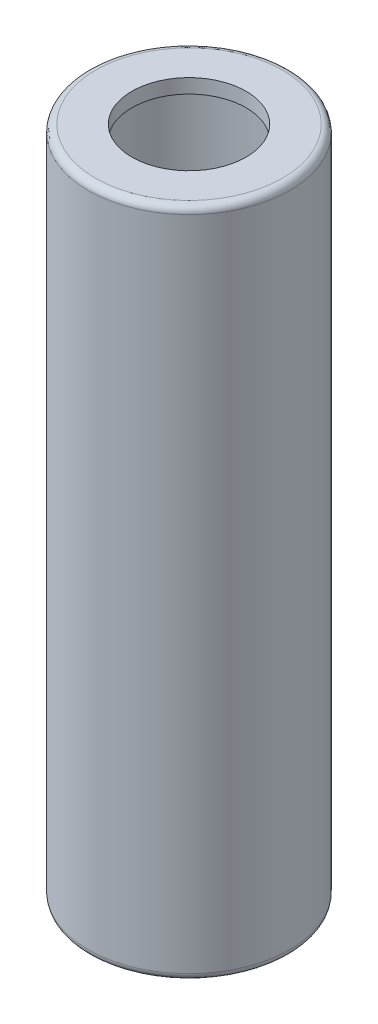
ISO-10303-21;
HEADER;
FILE_DESCRIPTION(('STEP AP214'),'2;1');
FILE_NAME('part.step','',(''),(''),'','','');
FILE_SCHEMA(('AUTOMOTIVE_DESIGN { 1 0 10303 214 1 1 1 1 }'));
ENDSEC;
DATA;
#1=APPLICATION_CONTEXT('core data for automotive mechanical design processes');
#2=APPLICATION_PROTOCOL_DEFINITION('international standard','automotive_design',2000,#1);
#3=PRODUCT_CONTEXT('',#1,'mechanical');
#4=PRODUCT('Part','Part','',(#3));
#5=PRODUCT_RELATED_PRODUCT_CATEGORY('part','',(#4));
#6=PRODUCT_DEFINITION_FORMATION('','',#4);
#7=PRODUCT_DEFINITION_CONTEXT('part definition',#1,'design');
#8=PRODUCT_DEFINITION('design','',#6,#7);
#9=PRODUCT_DEFINITION_SHAPE('','',#8);
#10=(LENGTH_UNIT() NAMED_UNIT(*) SI_UNIT(.MILLI.,.METRE.));
#11=(NAMED_UNIT(*) PLANE_ANGLE_UNIT() SI_UNIT($,.RADIAN.));
#12=(NAMED_UNIT(*) SI_UNIT($,.STERADIAN.) SOLID_ANGLE_UNIT());
#13=UNCERTAINTY_MEASURE_WITH_UNIT(LENGTH_MEASURE(1.E-05),#10,'distance_accuracy_value','');
#14=(GEOMETRIC_REPRESENTATION_CONTEXT(3) GLOBAL_UNCERTAINTY_ASSIGNED_CONTEXT((#13)) GLOBAL_UNIT_ASSIGNED_CONTEXT((#10,
#11,#12)) REPRESENTATION_CONTEXT('',''));
#15=CARTESIAN_POINT('',(0.,0.,0.));
#16=DIRECTION('',(0.,0.,1.));
#17=DIRECTION('',(1.,0.,0.));
#18=AXIS2_PLACEMENT_3D('',#15,#16,#17);
#19=CARTESIAN_POINT('',(0.,94.,0.));
#20=DIRECTION('',(0.,-1.,0.));
#21=DIRECTION('',(0.,0.,-1.));
#22=AXIS2_PLACEMENT_3D('',#19,#20,#21);
#23=CYLINDRICAL_SURFACE('',#22,14.1);
#24=CARTESIAN_POINT('',(0.,93.,0.));
#25=DIRECTION('',(0.,1.,0.));
#26=DIRECTION('',(0.,0.,1.));
#27=AXIS2_PLACEMENT_3D('',#24,#25,#26);
#28=CIRCLE('',#27,14.1);
#29=CARTESIAN_POINT('',(0.,93.,14.1));
#30=VERTEX_POINT('',#29);
#31=EDGE_CURVE('E10',#30,#30,#28,.F.);
#32=ORIENTED_EDGE('',*,*,#31,.T.);
#33=EDGE_LOOP('',(#32));
#34=FACE_BOUND('',#33,.T.);
#35=CARTESIAN_POINT('',(0.,0.916515138991172,0.));
#36=DIRECTION('',(0.,-1.,0.));
#37=DIRECTION('',(0.,0.,-1.));
#38=AXIS2_PLACEMENT_3D('',#35,#36,#37);
#39=CIRCLE('',#38,14.1);
#40=CARTESIAN_POINT('',(0.,0.916515138991172,-14.1));
#41=VERTEX_POINT('',#40);
#42=EDGE_CURVE('E50',#41,#41,#39,.F.);
#43=ORIENTED_EDGE('',*,*,#42,.T.);
#44=EDGE_LOOP('',(#43));
#45=FACE_BOUND('',#44,.T.);
#46=ADVANCED_FACE('F37',(#34,#45),#23,.T.);
#47=CARTESIAN_POINT('',(0.,94.,0.));
#48=DIRECTION('',(0.,1.,0.));
#49=DIRECTION('',(0.,0.,1.));
#50=AXIS2_PLACEMENT_3D('',#47,#48,#49);
#51=PLANE('',#50);
#52=CARTESIAN_POINT('',(0.,94.,0.));
#53=DIRECTION('',(0.,1.,0.));
#54=DIRECTION('',(0.,0.,1.));
#55=AXIS2_PLACEMENT_3D('',#52,#53,#54);
#56=CIRCLE('',#55,8.);
#57=CARTESIAN_POINT('',(0.,94.,8.));
#58=VERTEX_POINT('',#57);
#59=EDGE_CURVE('E70',#58,#58,#56,.T.);
#60=ORIENTED_EDGE('',*,*,#59,.F.);
#61=EDGE_LOOP('',(#60));
#62=FACE_BOUND('',#61,.T.);
#63=CARTESIAN_POINT('',(0.,94.,0.));
#64=DIRECTION('',(0.,1.,0.));
#65=DIRECTION('',(0.,0.,1.));
#66=AXIS2_PLACEMENT_3D('',#63,#64,#65);
#67=CIRCLE('',#66,13.1);
#68=CARTESIAN_POINT('',(0.,94.,13.1));
#69=VERTEX_POINT('',#68);
#70=EDGE_CURVE('E45',#69,#69,#67,.T.);
#71=ORIENTED_EDGE('',*,*,#70,.T.);
#72=EDGE_LOOP('',(#71));
#73=FACE_BOUND('',#72,.T.);
#74=ADVANCED_FACE('F87',(#62,#73),#51,.T.);
#75=CARTESIAN_POINT('',(0.,92.,0.));
#76=DIRECTION('',(0.,-1.,0.));
#77=DIRECTION('',(0.,0.,-1.));
#78=AXIS2_PLACEMENT_3D('',#75,#76,#77);
#79=CYLINDRICAL_SURFACE('',#78,12.5);
#80=CARTESIAN_POINT('',(0.,1.,0.));
#81=DIRECTION('',(0.,1.,0.));
#82=DIRECTION('',(0.,0.,1.));
#83=AXIS2_PLACEMENT_3D('',#80,#81,#82);
#84=CIRCLE('',#83,12.5);
#85=CARTESIAN_POINT('',(0.,1.,12.5));
#86=VERTEX_POINT('',#85);
#87=EDGE_CURVE('E61',#86,#86,#84,.F.);
#88=ORIENTED_EDGE('',*,*,#87,.T.);
#89=EDGE_LOOP('',(#88));
#90=FACE_BOUND('',#89,.T.);
#91=CARTESIAN_POINT('',(0.,92.,0.));
#92=DIRECTION('',(0.,-1.,0.));
#93=DIRECTION('',(0.,0.,-1.));
#94=AXIS2_PLACEMENT_3D('',#91,#92,#93);
#95=CIRCLE('',#94,12.5);
#96=CARTESIAN_POINT('',(0.,92.,-12.5));
#97=VERTEX_POINT('',#96);
#98=EDGE_CURVE('E65',#97,#97,#95,.T.);
#99=ORIENTED_EDGE('',*,*,#98,.F.);
#100=EDGE_LOOP('',(#99));
#101=FACE_BOUND('',#100,.T.);
#102=ADVANCED_FACE('F89',(#90,#101),#79,.F.);
#103=CARTESIAN_POINT('',(0.,92.,0.));
#104=DIRECTION('',(0.,-1.,0.));
#105=DIRECTION('',(0.,0.,-1.));
#106=AXIS2_PLACEMENT_3D('',#103,#104,#105);
#107=PLANE('',#106);
#108=CARTESIAN_POINT('',(0.,92.,0.));
#109=DIRECTION('',(0.,1.,0.));
#110=DIRECTION('',(0.,0.,1.));
#111=AXIS2_PLACEMENT_3D('',#108,#109,#110);
#112=CIRCLE('',#111,8.);
#113=CARTESIAN_POINT('',(0.,92.,8.));
#114=VERTEX_POINT('',#113);
#115=EDGE_CURVE('E69',#114,#114,#112,.T.);
#116=ORIENTED_EDGE('',*,*,#115,.T.);
#117=EDGE_LOOP('',(#116));
#118=FACE_BOUND('',#117,.T.);
#119=ORIENTED_EDGE('',*,*,#98,.T.);
#120=EDGE_LOOP('',(#119));
#121=FACE_BOUND('',#120,.T.);
#122=ADVANCED_FACE('F78',(#118,#121),#107,.T.);
#123=CARTESIAN_POINT('',(0.,1.,0.));
#124=DIRECTION('',(0.,1.,0.));
#125=DIRECTION('',(0.,0.,1.));
#126=AXIS2_PLACEMENT_3D('',#123,#124,#125);
#127=TOROIDAL_SURFACE('',#126,13.5,1.);
#128=CARTESIAN_POINT('',(0.,0.,0.));
#129=DIRECTION('',(0.,1.,0.));
#130=DIRECTION('',(0.,0.,1.));
#131=AXIS2_PLACEMENT_3D('',#128,#129,#130);
#132=CIRCLE('',#131,13.5);
#133=CARTESIAN_POINT('',(0.,0.,13.5));
#134=VERTEX_POINT('',#133);
#135=EDGE_CURVE('E55',#134,#134,#132,.T.);
#136=ORIENTED_EDGE('',*,*,#135,.F.);
#137=EDGE_LOOP('',(#136));
#138=FACE_BOUND('',#137,.T.);
#139=ORIENTED_EDGE('',*,*,#87,.F.);
#140=EDGE_LOOP('',(#139));
#141=FACE_BOUND('',#140,.T.);
#142=ADVANCED_FACE('F100',(#138,#141),#127,.T.);
#143=CARTESIAN_POINT('',(0.,0.916515138991168,0.));
#144=DIRECTION('',(0.,-1.,0.));
#145=DIRECTION('',(0.,0.,-1.));
#146=AXIS2_PLACEMENT_3D('',#143,#144,#145);
#147=TOROIDAL_SURFACE('',#146,13.1,1.);
#148=ORIENTED_EDGE('',*,*,#135,.T.);
#149=EDGE_LOOP('',(#148));
#150=FACE_BOUND('',#149,.T.);
#151=ORIENTED_EDGE('',*,*,#42,.F.);
#152=EDGE_LOOP('',(#151));
#153=FACE_BOUND('',#152,.T.);
#154=ADVANCED_FACE('F102',(#150,#153),#147,.T.);
#155=CARTESIAN_POINT('',(0.,93.,0.));
#156=DIRECTION('',(0.,1.,0.));
#157=DIRECTION('',(0.,0.,1.));
#158=AXIS2_PLACEMENT_3D('',#155,#156,#157);
#159=TOROIDAL_SURFACE('',#158,13.1,1.);
#160=ORIENTED_EDGE('',*,*,#31,.F.);
#161=EDGE_LOOP('',(#160));
#162=FACE_BOUND('',#161,.T.);
#163=ORIENTED_EDGE('',*,*,#70,.F.);
#164=EDGE_LOOP('',(#163));
#165=FACE_BOUND('',#164,.T.);
#166=ADVANCED_FACE('F39',(#162,#165),#159,.T.);
#167=CARTESIAN_POINT('',(0.,92.,0.));
#168=DIRECTION('',(0.,1.,0.));
#169=DIRECTION('',(0.,0.,1.));
#170=AXIS2_PLACEMENT_3D('',#167,#168,#169);
#171=CYLINDRICAL_SURFACE('',#170,8.);
#172=ORIENTED_EDGE('',*,*,#115,.F.);
#173=EDGE_LOOP('',(#172));
#174=FACE_BOUND('',#173,.T.);
#175=ORIENTED_EDGE('',*,*,#59,.T.);
#176=EDGE_LOOP('',(#175));
#177=FACE_BOUND('',#176,.T.);
#178=ADVANCED_FACE('F81',(#174,#177),#171,.F.);
#179=CLOSED_SHELL('',(#46,#74,#102,#122,#142,#154,#166,#178));
#180=MANIFOLD_SOLID_BREP('B2',#179);
#181=ADVANCED_BREP_SHAPE_REPRESENTATION('',(#18,#180),#14);
#182=SHAPE_DEFINITION_REPRESENTATION(#9,#181);
ENDSEC;
END-ISO-10303-21;
